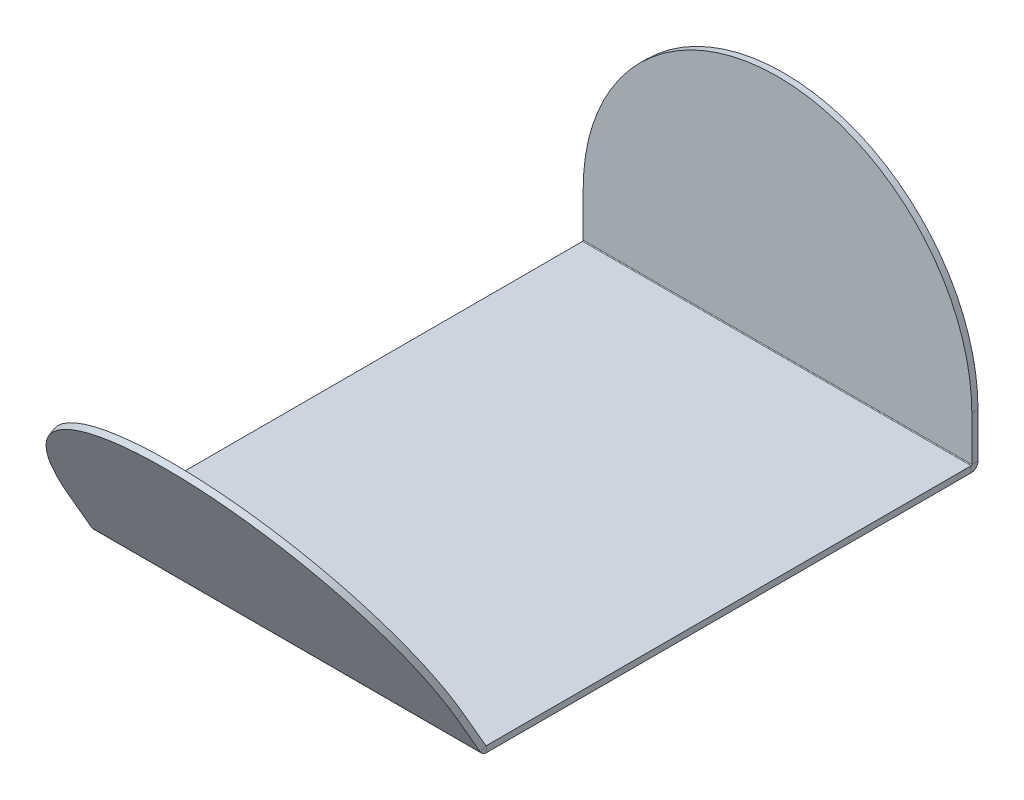
ISO-10303-21;
HEADER;
FILE_DESCRIPTION(('STEP AP214'),'2;1');
FILE_NAME('part.step','',(''),(''),'','','');
FILE_SCHEMA(('AUTOMOTIVE_DESIGN { 1 0 10303 214 1 1 1 1 }'));
ENDSEC;
DATA;
#1=APPLICATION_CONTEXT('core data for automotive mechanical design processes');
#2=APPLICATION_PROTOCOL_DEFINITION('international standard','automotive_design',2000,#1);
#3=PRODUCT_CONTEXT('',#1,'mechanical');
#4=PRODUCT('Part','Part','',(#3));
#5=PRODUCT_RELATED_PRODUCT_CATEGORY('part','',(#4));
#6=PRODUCT_DEFINITION_FORMATION('','',#4);
#7=PRODUCT_DEFINITION_CONTEXT('part definition',#1,'design');
#8=PRODUCT_DEFINITION('design','',#6,#7);
#9=PRODUCT_DEFINITION_SHAPE('','',#8);
#10=(LENGTH_UNIT() NAMED_UNIT(*) SI_UNIT(.MILLI.,.METRE.));
#11=(NAMED_UNIT(*) PLANE_ANGLE_UNIT() SI_UNIT($,.RADIAN.));
#12=(NAMED_UNIT(*) SI_UNIT($,.STERADIAN.) SOLID_ANGLE_UNIT());
#13=UNCERTAINTY_MEASURE_WITH_UNIT(LENGTH_MEASURE(1.E-05),#10,'distance_accuracy_value','');
#14=(GEOMETRIC_REPRESENTATION_CONTEXT(3) GLOBAL_UNCERTAINTY_ASSIGNED_CONTEXT((#13)) GLOBAL_UNIT_ASSIGNED_CONTEXT((#10,
#11,#12)) REPRESENTATION_CONTEXT('',''));
#15=CARTESIAN_POINT('',(0.,0.,0.));
#16=DIRECTION('',(0.,0.,1.));
#17=DIRECTION('',(1.,0.,0.));
#18=AXIS2_PLACEMENT_3D('',#15,#16,#17);
#19=CARTESIAN_POINT('',(0.,-6.35,-300.));
#20=DIRECTION('',(0.,1.,0.));
#21=DIRECTION('',(0.,0.,1.));
#22=AXIS2_PLACEMENT_3D('',#19,#20,#21);
#23=PLANE('',#22);
#24=DIRECTION('',(0.,0.,-1.));
#25=VECTOR('',#24,1.);
#26=CARTESIAN_POINT('',(200.,-6.35,-300.));
#27=LINE('',#26,#25);
#28=CARTESIAN_POINT('',(200.,-6.35,249.574723791715));
#29=VERTEX_POINT('',#28);
#30=CARTESIAN_POINT('',(200.,-6.35000000000001,-249.2634));
#31=VERTEX_POINT('',#30);
#32=EDGE_CURVE('E96',#29,#31,#27,.T.);
#33=ORIENTED_EDGE('',*,*,#32,.F.);
#34=DIRECTION('',(-1.,0.,0.));
#35=VECTOR('',#34,1.);
#36=CARTESIAN_POINT('',(-2.43984092692818E-13,-6.35,249.574723791715));
#37=LINE('',#36,#35);
#38=CARTESIAN_POINT('',(-200.,-6.35,249.574723791715));
#39=VERTEX_POINT('',#38);
#40=EDGE_CURVE('E272',#29,#39,#37,.T.);
#41=ORIENTED_EDGE('',*,*,#40,.T.);
#42=DIRECTION('',(0.,0.,1.));
#43=VECTOR('',#42,1.);
#44=CARTESIAN_POINT('',(-200.,-6.35,-300.));
#45=LINE('',#44,#43);
#46=CARTESIAN_POINT('',(-200.,-6.35,-249.263400000001));
#47=VERTEX_POINT('',#46);
#48=EDGE_CURVE('E241',#47,#39,#45,.T.);
#49=ORIENTED_EDGE('',*,*,#48,.F.);
#50=DIRECTION('',(-1.,0.,0.));
#51=VECTOR('',#50,1.);
#52=CARTESIAN_POINT('',(0.,-6.35,-249.2634));
#53=LINE('',#52,#51);
#54=EDGE_CURVE('E233',#31,#47,#53,.T.);
#55=ORIENTED_EDGE('',*,*,#54,.F.);
#56=EDGE_LOOP('',(#33,#41,#49,#55));
#57=FACE_BOUND('',#56,.T.);
#58=ADVANCED_FACE('F92',(#57),#23,.F.);
#59=CARTESIAN_POINT('',(0.,46.7253110226296,-256.35));
#60=DIRECTION('',(0.,0.,1.));
#61=DIRECTION('',(0.,-1.,0.));
#62=AXIS2_PLACEMENT_3D('',#59,#60,#61);
#63=PLANE('',#62);
#64=DIRECTION('',(0.,1.,0.));
#65=VECTOR('',#64,1.);
#66=CARTESIAN_POINT('',(200.,46.7253110226296,-256.35));
#67=LINE('',#66,#65);
#68=CARTESIAN_POINT('',(200.,0.736600000000372,-256.35));
#69=VERTEX_POINT('',#68);
#70=CARTESIAN_POINT('',(200.,46.7253110226296,-256.35));
#71=VERTEX_POINT('',#70);
#72=EDGE_CURVE('E262',#69,#71,#67,.T.);
#73=ORIENTED_EDGE('',*,*,#72,.F.);
#74=DIRECTION('',(-1.,0.,0.));
#75=VECTOR('',#74,1.);
#76=CARTESIAN_POINT('',(0.,0.736600000000032,-256.35));
#77=LINE('',#76,#75);
#78=CARTESIAN_POINT('',(-200.,0.736600000000032,-256.35));
#79=VERTEX_POINT('',#78);
#80=EDGE_CURVE('E259',#69,#79,#77,.T.);
#81=ORIENTED_EDGE('',*,*,#80,.T.);
#82=DIRECTION('',(0.,-1.,0.));
#83=VECTOR('',#82,1.);
#84=CARTESIAN_POINT('',(-200.,46.7253110226297,-256.35));
#85=LINE('',#84,#83);
#86=CARTESIAN_POINT('',(-200.,46.7253110226297,-256.35));
#87=VERTEX_POINT('',#86);
#88=EDGE_CURVE('E250',#87,#79,#85,.T.);
#89=ORIENTED_EDGE('',*,*,#88,.F.);
#90=CARTESIAN_POINT('',(0.,46.7253110226296,-256.35));
#91=DIRECTION('',(0.,0.,1.));
#92=DIRECTION('',(0.,-1.,0.));
#93=AXIS2_PLACEMENT_3D('',#90,#91,#92);
#94=CIRCLE('',#93,200.);
#95=EDGE_CURVE('E247',#71,#87,#94,.T.);
#96=ORIENTED_EDGE('',*,*,#95,.F.);
#97=EDGE_LOOP('',(#73,#81,#89,#96));
#98=FACE_BOUND('',#97,.T.);
#99=ADVANCED_FACE('F316',(#98),#63,.F.);
#100=CARTESIAN_POINT('',(0.,46.7253110226296,-256.35));
#101=DIRECTION('',(0.,0.,1.));
#102=DIRECTION('',(0.,-1.,0.));
#103=AXIS2_PLACEMENT_3D('',#100,#101,#102);
#104=CYLINDRICAL_SURFACE('',#103,200.);
#105=CARTESIAN_POINT('',(0.,46.7253110226296,-250.));
#106=DIRECTION('',(0.,0.,1.));
#107=DIRECTION('',(0.,-1.,0.));
#108=AXIS2_PLACEMENT_3D('',#105,#106,#107);
#109=CIRCLE('',#108,200.);
#110=CARTESIAN_POINT('',(200.,46.7253110226296,-250.));
#111=VERTEX_POINT('',#110);
#112=CARTESIAN_POINT('',(-200.,46.7253110226297,-250.));
#113=VERTEX_POINT('',#112);
#114=EDGE_CURVE('E252',#111,#113,#109,.T.);
#115=ORIENTED_EDGE('',*,*,#114,.F.);
#116=DIRECTION('',(0.,0.,1.));
#117=VECTOR('',#116,1.);
#118=CARTESIAN_POINT('',(200.,46.7253110226296,-256.35));
#119=LINE('',#118,#117);
#120=EDGE_CURVE('E256',#71,#111,#119,.T.);
#121=ORIENTED_EDGE('',*,*,#120,.F.);
#122=ORIENTED_EDGE('',*,*,#95,.T.);
#123=DIRECTION('',(0.,0.,1.));
#124=VECTOR('',#123,1.);
#125=CARTESIAN_POINT('',(-200.,46.7253110226297,-256.35));
#126=LINE('',#125,#124);
#127=EDGE_CURVE('E260',#87,#113,#126,.T.);
#128=ORIENTED_EDGE('',*,*,#127,.T.);
#129=EDGE_LOOP('',(#115,#121,#122,#128));
#130=FACE_BOUND('',#129,.T.);
#131=ADVANCED_FACE('F321',(#130),#104,.T.);
#132=CARTESIAN_POINT('',(200.,46.7253110226296,-256.35));
#133=DIRECTION('',(1.,0.,0.));
#134=DIRECTION('',(0.,1.,0.));
#135=AXIS2_PLACEMENT_3D('',#132,#133,#134);
#136=PLANE('',#135);
#137=DIRECTION('',(0.,0.,1.));
#138=VECTOR('',#137,1.);
#139=CARTESIAN_POINT('',(200.,0.736600000000032,-256.35));
#140=LINE('',#139,#138);
#141=CARTESIAN_POINT('',(200.,0.736600000000039,-250.));
#142=VERTEX_POINT('',#141);
#143=EDGE_CURVE('E265',#69,#142,#140,.T.);
#144=ORIENTED_EDGE('',*,*,#143,.F.);
#145=ORIENTED_EDGE('',*,*,#72,.T.);
#146=ORIENTED_EDGE('',*,*,#120,.T.);
#147=DIRECTION('',(0.,1.,0.));
#148=VECTOR('',#147,1.);
#149=CARTESIAN_POINT('',(200.,46.7253110226296,-250.));
#150=LINE('',#149,#148);
#151=EDGE_CURVE('E251',#142,#111,#150,.T.);
#152=ORIENTED_EDGE('',*,*,#151,.F.);
#153=EDGE_LOOP('',(#144,#145,#146,#152));
#154=FACE_BOUND('',#153,.T.);
#155=ADVANCED_FACE('F324',(#154),#136,.T.);
#156=CARTESIAN_POINT('',(-200.,46.7253110226297,-256.35));
#157=DIRECTION('',(-1.,0.,0.));
#158=DIRECTION('',(0.,-1.,0.));
#159=AXIS2_PLACEMENT_3D('',#156,#157,#158);
#160=PLANE('',#159);
#161=DIRECTION('',(0.,0.,-1.));
#162=VECTOR('',#161,1.);
#163=CARTESIAN_POINT('',(-200.,0.736600000000032,-256.35));
#164=LINE('',#163,#162);
#165=CARTESIAN_POINT('',(-200.,0.736600000000039,-250.));
#166=VERTEX_POINT('',#165);
#167=EDGE_CURVE('E269',#166,#79,#164,.T.);
#168=ORIENTED_EDGE('',*,*,#167,.F.);
#169=DIRECTION('',(0.,-1.,0.));
#170=VECTOR('',#169,1.);
#171=CARTESIAN_POINT('',(-200.,46.7253110226297,-250.));
#172=LINE('',#171,#170);
#173=EDGE_CURVE('E255',#113,#166,#172,.T.);
#174=ORIENTED_EDGE('',*,*,#173,.F.);
#175=ORIENTED_EDGE('',*,*,#127,.F.);
#176=ORIENTED_EDGE('',*,*,#88,.T.);
#177=EDGE_LOOP('',(#168,#174,#175,#176));
#178=FACE_BOUND('',#177,.T.);
#179=ADVANCED_FACE('F318',(#178),#160,.T.);
#180=CARTESIAN_POINT('',(0.,46.7253110226296,-250.));
#181=DIRECTION('',(0.,0.,1.));
#182=DIRECTION('',(0.,-1.,0.));
#183=AXIS2_PLACEMENT_3D('',#180,#181,#182);
#184=PLANE('',#183);
#185=DIRECTION('',(-1.,0.,0.));
#186=VECTOR('',#185,1.);
#187=CARTESIAN_POINT('',(0.,0.736600000000032,-250.));
#188=LINE('',#187,#186);
#189=EDGE_CURVE('E267',#142,#166,#188,.T.);
#190=ORIENTED_EDGE('',*,*,#189,.F.);
#191=ORIENTED_EDGE('',*,*,#151,.T.);
#192=ORIENTED_EDGE('',*,*,#114,.T.);
#193=ORIENTED_EDGE('',*,*,#173,.T.);
#194=EDGE_LOOP('',(#190,#191,#192,#193));
#195=FACE_BOUND('',#194,.T.);
#196=ADVANCED_FACE('F327',(#195),#184,.T.);
#197=CARTESIAN_POINT('',(200.,-6.35,-300.));
#198=DIRECTION('',(1.,0.,0.));
#199=DIRECTION('',(0.,0.,-1.));
#200=AXIS2_PLACEMENT_3D('',#197,#198,#199);
#201=PLANE('',#200);
#202=DIRECTION('',(0.,1.,0.));
#203=VECTOR('',#202,1.);
#204=CARTESIAN_POINT('',(200.,-6.34999999999997,249.574723791715));
#205=LINE('',#204,#203);
#206=CARTESIAN_POINT('',(200.,0.,249.574723791715));
#207=VERTEX_POINT('',#206);
#208=EDGE_CURVE('E281',#29,#207,#205,.T.);
#209=ORIENTED_EDGE('',*,*,#208,.F.);
#210=ORIENTED_EDGE('',*,*,#32,.T.);
#211=DIRECTION('',(0.,1.,0.));
#212=VECTOR('',#211,1.);
#213=CARTESIAN_POINT('',(200.,-6.35,-249.2634));
#214=LINE('',#213,#212);
#215=CARTESIAN_POINT('',(200.,0.,-249.2634));
#216=VERTEX_POINT('',#215);
#217=EDGE_CURVE('E244',#31,#216,#214,.T.);
#218=ORIENTED_EDGE('',*,*,#217,.T.);
#219=DIRECTION('',(0.,0.,-1.));
#220=VECTOR('',#219,1.);
#221=CARTESIAN_POINT('',(200.,0.,-300.));
#222=LINE('',#221,#220);
#223=EDGE_CURVE('E117',#207,#216,#222,.T.);
#224=ORIENTED_EDGE('',*,*,#223,.F.);
#225=EDGE_LOOP('',(#209,#210,#218,#224));
#226=FACE_BOUND('',#225,.T.);
#227=ADVANCED_FACE('F299',(#226),#201,.T.);
#228=CARTESIAN_POINT('',(0.,0.,-300.));
#229=DIRECTION('',(0.,1.,0.));
#230=DIRECTION('',(0.,0.,1.));
#231=AXIS2_PLACEMENT_3D('',#228,#229,#230);
#232=PLANE('',#231);
#233=DIRECTION('',(-1.,0.,0.));
#234=VECTOR('',#233,1.);
#235=CARTESIAN_POINT('',(-2.43984092692818E-13,0.,249.574723791715));
#236=LINE('',#235,#234);
#237=CARTESIAN_POINT('',(-200.,0.,249.574723791715));
#238=VERTEX_POINT('',#237);
#239=EDGE_CURVE('E101',#207,#238,#236,.T.);
#240=ORIENTED_EDGE('',*,*,#239,.F.);
#241=ORIENTED_EDGE('',*,*,#223,.T.);
#242=DIRECTION('',(-1.,0.,0.));
#243=VECTOR('',#242,1.);
#244=CARTESIAN_POINT('',(0.,0.,-249.2634));
#245=LINE('',#244,#243);
#246=CARTESIAN_POINT('',(-200.,0.,-249.2634));
#247=VERTEX_POINT('',#246);
#248=EDGE_CURVE('E242',#216,#247,#245,.T.);
#249=ORIENTED_EDGE('',*,*,#248,.T.);
#250=DIRECTION('',(0.,0.,1.));
#251=VECTOR('',#250,1.);
#252=CARTESIAN_POINT('',(-200.,0.,-300.));
#253=LINE('',#252,#251);
#254=EDGE_CURVE('E109',#247,#238,#253,.T.);
#255=ORIENTED_EDGE('',*,*,#254,.T.);
#256=EDGE_LOOP('',(#240,#241,#249,#255));
#257=FACE_BOUND('',#256,.T.);
#258=ADVANCED_FACE('F287',(#257),#232,.T.);
#259=CARTESIAN_POINT('',(-200.,-6.35,-300.));
#260=DIRECTION('',(-1.,0.,0.));
#261=DIRECTION('',(0.,0.,1.));
#262=AXIS2_PLACEMENT_3D('',#259,#260,#261);
#263=PLANE('',#262);
#264=DIRECTION('',(0.,-1.,0.));
#265=VECTOR('',#264,1.);
#266=CARTESIAN_POINT('',(-200.,-6.34999999999997,249.574723791715));
#267=LINE('',#266,#265);
#268=EDGE_CURVE('E12',#238,#39,#267,.T.);
#269=ORIENTED_EDGE('',*,*,#268,.F.);
#270=ORIENTED_EDGE('',*,*,#254,.F.);
#271=DIRECTION('',(0.,-1.,0.));
#272=VECTOR('',#271,1.);
#273=CARTESIAN_POINT('',(-200.,-6.35,-249.2634));
#274=LINE('',#273,#272);
#275=EDGE_CURVE('E238',#247,#47,#274,.T.);
#276=ORIENTED_EDGE('',*,*,#275,.T.);
#277=ORIENTED_EDGE('',*,*,#48,.T.);
#278=EDGE_LOOP('',(#269,#270,#276,#277));
#279=FACE_BOUND('',#278,.T.);
#280=ADVANCED_FACE('F94',(#279),#263,.T.);
#281=CARTESIAN_POINT('',(200.,0.7366,-249.2634));
#282=DIRECTION('',(1.,0.,0.));
#283=DIRECTION('',(0.,0.,-1.));
#284=AXIS2_PLACEMENT_3D('',#281,#282,#283);
#285=PLANE('',#284);
#286=ORIENTED_EDGE('',*,*,#143,.T.);
#287=CARTESIAN_POINT('',(200.,0.7366,-249.2634));
#288=DIRECTION('',(1.,0.,0.));
#289=DIRECTION('',(0.,0.,-1.));
#290=AXIS2_PLACEMENT_3D('',#287,#288,#289);
#291=CIRCLE('',#290,0.7366);
#292=EDGE_CURVE('E222',#142,#216,#291,.F.);
#293=ORIENTED_EDGE('',*,*,#292,.T.);
#294=ORIENTED_EDGE('',*,*,#217,.F.);
#295=CARTESIAN_POINT('',(200.,0.7366,-249.2634));
#296=DIRECTION('',(-1.,0.,0.));
#297=DIRECTION('',(0.,0.,-1.));
#298=AXIS2_PLACEMENT_3D('',#295,#296,#297);
#299=CIRCLE('',#298,7.08660000000001);
#300=EDGE_CURVE('E227',#69,#31,#299,.T.);
#301=ORIENTED_EDGE('',*,*,#300,.F.);
#302=EDGE_LOOP('',(#286,#293,#294,#301));
#303=FACE_BOUND('',#302,.T.);
#304=ADVANCED_FACE('F292',(#303),#285,.T.);
#305=CARTESIAN_POINT('',(-200.,0.7366,-249.2634));
#306=DIRECTION('',(-1.,0.,0.));
#307=DIRECTION('',(0.,0.,1.));
#308=AXIS2_PLACEMENT_3D('',#305,#306,#307);
#309=PLANE('',#308);
#310=CARTESIAN_POINT('',(-200.,0.7366,-249.2634));
#311=DIRECTION('',(1.,0.,0.));
#312=DIRECTION('',(0.,0.,-1.));
#313=AXIS2_PLACEMENT_3D('',#310,#311,#312);
#314=CIRCLE('',#313,0.7366);
#315=EDGE_CURVE('E231',#247,#166,#314,.T.);
#316=ORIENTED_EDGE('',*,*,#315,.T.);
#317=ORIENTED_EDGE('',*,*,#167,.T.);
#318=CARTESIAN_POINT('',(-200.,0.7366,-249.2634));
#319=DIRECTION('',(1.,0.,0.));
#320=DIRECTION('',(0.,0.,1.));
#321=AXIS2_PLACEMENT_3D('',#318,#319,#320);
#322=CIRCLE('',#321,7.08660000000001);
#323=EDGE_CURVE('E230',#47,#79,#322,.T.);
#324=ORIENTED_EDGE('',*,*,#323,.F.);
#325=ORIENTED_EDGE('',*,*,#275,.F.);
#326=EDGE_LOOP('',(#316,#317,#324,#325));
#327=FACE_BOUND('',#326,.T.);
#328=ADVANCED_FACE('F309',(#327),#309,.T.);
#329=CARTESIAN_POINT('',(-400.078573469939,0.7366,-249.2634));
#330=DIRECTION('',(1.,0.,0.));
#331=DIRECTION('',(0.,0.,-1.));
#332=AXIS2_PLACEMENT_3D('',#329,#330,#331);
#333=CYLINDRICAL_SURFACE('',#332,7.0866);
#334=ORIENTED_EDGE('',*,*,#54,.T.);
#335=ORIENTED_EDGE('',*,*,#323,.T.);
#336=ORIENTED_EDGE('',*,*,#80,.F.);
#337=ORIENTED_EDGE('',*,*,#300,.T.);
#338=EDGE_LOOP('',(#334,#335,#336,#337));
#339=FACE_BOUND('',#338,.T.);
#340=ADVANCED_FACE('F307',(#339),#333,.T.);
#341=CARTESIAN_POINT('',(-400.078573469939,0.7366,-249.2634));
#342=DIRECTION('',(1.,0.,0.));
#343=DIRECTION('',(0.,0.,-1.));
#344=AXIS2_PLACEMENT_3D('',#341,#342,#343);
#345=CYLINDRICAL_SURFACE('',#344,0.7366);
#346=ORIENTED_EDGE('',*,*,#248,.F.);
#347=ORIENTED_EDGE('',*,*,#292,.F.);
#348=ORIENTED_EDGE('',*,*,#189,.T.);
#349=ORIENTED_EDGE('',*,*,#315,.F.);
#350=EDGE_LOOP('',(#346,#347,#348,#349));
#351=FACE_BOUND('',#350,.T.);
#352=ADVANCED_FACE('F298',(#351),#345,.F.);
#353=CARTESIAN_POINT('',(200.,0.7366,249.574723791715));
#354=DIRECTION('',(1.,0.,0.));
#355=DIRECTION('',(0.,0.,-1.));
#356=AXIS2_PLACEMENT_3D('',#353,#354,#355);
#357=PLANE('',#356);
#358=ORIENTED_EDGE('',*,*,#208,.T.);
#359=CARTESIAN_POINT('',(200.,0.7366,249.574723791715));
#360=DIRECTION('',(-1.,0.,0.));
#361=DIRECTION('',(0.,0.,1.));
#362=AXIS2_PLACEMENT_3D('',#359,#360,#361);
#363=CIRCLE('',#362,0.7366);
#364=CARTESIAN_POINT('',(200.,0.368299999999822,250.212638104143));
#365=VERTEX_POINT('',#364);
#366=EDGE_CURVE('E203',#207,#365,#363,.T.);
#367=ORIENTED_EDGE('',*,*,#366,.T.);
#368=DIRECTION('',(0.,0.499999999999998,-0.86602540378444));
#369=VECTOR('',#368,1.);
#370=CARTESIAN_POINT('',(200.,-2.80670000000013,255.711899418174));
#371=LINE('',#370,#369);
#372=CARTESIAN_POINT('',(200.,-2.80670000000016,255.711899418174));
#373=VERTEX_POINT('',#372);
#374=EDGE_CURVE('E366',#373,#365,#371,.T.);
#375=ORIENTED_EDGE('',*,*,#374,.F.);
#376=CARTESIAN_POINT('',(200.,0.7366,249.574723791715));
#377=DIRECTION('',(-1.,0.,0.));
#378=DIRECTION('',(0.,0.,-1.));
#379=AXIS2_PLACEMENT_3D('',#376,#377,#378);
#380=CIRCLE('',#379,7.08660000000001);
#381=EDGE_CURVE('E215',#29,#373,#380,.T.);
#382=ORIENTED_EDGE('',*,*,#381,.F.);
#383=EDGE_LOOP('',(#358,#367,#375,#382));
#384=FACE_BOUND('',#383,.T.);
#385=ADVANCED_FACE('F364',(#384),#357,.T.);
#386=CARTESIAN_POINT('',(-200.,0.7366,249.574723791715));
#387=DIRECTION('',(-1.,0.,0.));
#388=DIRECTION('',(0.,0.,1.));
#389=AXIS2_PLACEMENT_3D('',#386,#387,#388);
#390=PLANE('',#389);
#391=DIRECTION('',(0.,-0.499999999999998,0.86602540378444));
#392=VECTOR('',#391,1.);
#393=CARTESIAN_POINT('',(-200.,-2.80670000000019,255.711899418174));
#394=LINE('',#393,#392);
#395=CARTESIAN_POINT('',(-200.,0.368299999999794,250.212638104143));
#396=VERTEX_POINT('',#395);
#397=CARTESIAN_POINT('',(-200.,-2.80669999999975,255.711899418174));
#398=VERTEX_POINT('',#397);
#399=EDGE_CURVE('E191',#396,#398,#394,.T.);
#400=ORIENTED_EDGE('',*,*,#399,.F.);
#401=CARTESIAN_POINT('',(-200.,0.7366,249.574723791715));
#402=DIRECTION('',(-1.,0.,0.));
#403=DIRECTION('',(0.,0.,1.));
#404=AXIS2_PLACEMENT_3D('',#401,#402,#403);
#405=CIRCLE('',#404,0.7366);
#406=EDGE_CURVE('E219',#396,#238,#405,.F.);
#407=ORIENTED_EDGE('',*,*,#406,.T.);
#408=ORIENTED_EDGE('',*,*,#268,.T.);
#409=CARTESIAN_POINT('',(-200.,0.7366,249.574723791715));
#410=DIRECTION('',(1.,0.,0.));
#411=DIRECTION('',(0.,0.,1.));
#412=AXIS2_PLACEMENT_3D('',#409,#410,#411);
#413=CIRCLE('',#412,7.0866);
#414=EDGE_CURVE('E218',#398,#39,#413,.T.);
#415=ORIENTED_EDGE('',*,*,#414,.F.);
#416=EDGE_LOOP('',(#400,#407,#408,#415));
#417=FACE_BOUND('',#416,.T.);
#418=ADVANCED_FACE('F355',(#417),#390,.T.);
#419=CARTESIAN_POINT('',(400.062921759255,0.7366,249.574723791715));
#420=DIRECTION('',(-1.,0.,0.));
#421=DIRECTION('',(0.,0.,1.));
#422=AXIS2_PLACEMENT_3D('',#419,#420,#421);
#423=CYLINDRICAL_SURFACE('',#422,7.0866);
#424=ORIENTED_EDGE('',*,*,#414,.T.);
#425=ORIENTED_EDGE('',*,*,#40,.F.);
#426=ORIENTED_EDGE('',*,*,#381,.T.);
#427=DIRECTION('',(-1.,0.,0.));
#428=VECTOR('',#427,1.);
#429=CARTESIAN_POINT('',(-2.39069837322764E-13,-2.80670000000011,255.711899418174));
#430=LINE('',#429,#428);
#431=EDGE_CURVE('E209',#373,#398,#430,.T.);
#432=ORIENTED_EDGE('',*,*,#431,.T.);
#433=EDGE_LOOP('',(#424,#425,#426,#432));
#434=FACE_BOUND('',#433,.T.);
#435=ADVANCED_FACE('F368',(#434),#423,.T.);
#436=CARTESIAN_POINT('',(400.062921759255,0.7366,249.574723791715));
#437=DIRECTION('',(-1.,0.,0.));
#438=DIRECTION('',(0.,0.,1.));
#439=AXIS2_PLACEMENT_3D('',#436,#437,#438);
#440=CYLINDRICAL_SURFACE('',#439,0.7366);
#441=ORIENTED_EDGE('',*,*,#406,.F.);
#442=DIRECTION('',(-1.,0.,0.));
#443=VECTOR('',#442,1.);
#444=CARTESIAN_POINT('',(-2.37543485690447E-13,0.368299999999794,250.212638104143));
#445=LINE('',#444,#443);
#446=EDGE_CURVE('E361',#365,#396,#445,.T.);
#447=ORIENTED_EDGE('',*,*,#446,.F.);
#448=ORIENTED_EDGE('',*,*,#366,.F.);
#449=ORIENTED_EDGE('',*,*,#239,.T.);
#450=EDGE_LOOP('',(#441,#447,#448,#449));
#451=FACE_BOUND('',#450,.T.);
#452=ADVANCED_FACE('F359',(#451),#440,.F.);
#453=CARTESIAN_POINT('',(1.04601991381176E-13,38.1216752100545,279.341907863193));
#454=DIRECTION('',(0.,0.499999999999998,-0.86602540378444));
#455=DIRECTION('',(0.,0.86602540378444,0.499999999999998));
#456=AXIS2_PLACEMENT_3D('',#453,#454,#455);
#457=CYLINDRICAL_SURFACE('',#456,200.);
#458=CARTESIAN_POINT('',(1.06128343013493E-13,41.2966752100545,273.842646549162));
#459=DIRECTION('',(0.,0.499999999999998,-0.86602540378444));
#460=DIRECTION('',(0.,0.86602540378444,0.499999999999998));
#461=AXIS2_PLACEMENT_3D('',#458,#459,#460);
#462=CIRCLE('',#461,200.);
#463=CARTESIAN_POINT('',(-200.,41.2966752100545,273.842646549162));
#464=VERTEX_POINT('',#463);
#465=CARTESIAN_POINT('',(200.,41.2966752100545,273.842646549162));
#466=VERTEX_POINT('',#465);
#467=EDGE_CURVE('E202',#464,#466,#462,.T.);
#468=ORIENTED_EDGE('',*,*,#467,.F.);
#469=DIRECTION('',(0.,0.499999999999998,-0.86602540378444));
#470=VECTOR('',#469,1.);
#471=CARTESIAN_POINT('',(-200.,38.1216752100545,279.341907863193));
#472=LINE('',#471,#470);
#473=CARTESIAN_POINT('',(-200.,38.1216752100545,279.341907863193));
#474=VERTEX_POINT('',#473);
#475=EDGE_CURVE('E188',#474,#464,#472,.T.);
#476=ORIENTED_EDGE('',*,*,#475,.F.);
#477=CARTESIAN_POINT('',(1.04601991381176E-13,38.1216752100545,279.341907863193));
#478=DIRECTION('',(0.,0.499999999999998,-0.86602540378444));
#479=DIRECTION('',(0.,0.86602540378444,0.499999999999998));
#480=AXIS2_PLACEMENT_3D('',#477,#478,#479);
#481=CIRCLE('',#480,200.);
#482=CARTESIAN_POINT('',(200.,38.1216752100545,279.341907863193));
#483=VERTEX_POINT('',#482);
#484=EDGE_CURVE('E199',#474,#483,#481,.T.);
#485=ORIENTED_EDGE('',*,*,#484,.T.);
#486=DIRECTION('',(0.,0.499999999999998,-0.86602540378444));
#487=VECTOR('',#486,1.);
#488=CARTESIAN_POINT('',(200.,38.1216752100545,279.341907863193));
#489=LINE('',#488,#487);
#490=EDGE_CURVE('E208',#483,#466,#489,.T.);
#491=ORIENTED_EDGE('',*,*,#490,.T.);
#492=EDGE_LOOP('',(#468,#476,#485,#491));
#493=FACE_BOUND('',#492,.T.);
#494=ADVANCED_FACE('F198',(#493),#457,.T.);
#495=CARTESIAN_POINT('',(-1.62361755337814E-13,-481.493567060609,-20.6580921368059));
#496=DIRECTION('',(0.,0.499999999999998,-0.86602540378444));
#497=DIRECTION('',(0.,0.86602540378444,0.499999999999998));
#498=AXIS2_PLACEMENT_3D('',#495,#496,#497);
#499=PLANE('',#498);
#500=ORIENTED_EDGE('',*,*,#431,.F.);
#501=DIRECTION('',(0.,-0.86602540378444,-0.499999999999998));
#502=VECTOR('',#501,1.);
#503=CARTESIAN_POINT('',(200.,-481.49356706061,-20.6580921368059));
#504=LINE('',#503,#502);
#505=EDGE_CURVE('E207',#483,#373,#504,.T.);
#506=ORIENTED_EDGE('',*,*,#505,.F.);
#507=ORIENTED_EDGE('',*,*,#484,.F.);
#508=DIRECTION('',(0.,0.86602540378444,0.499999999999998));
#509=VECTOR('',#508,1.);
#510=CARTESIAN_POINT('',(-200.,-481.493567060609,-20.6580921368059));
#511=LINE('',#510,#509);
#512=EDGE_CURVE('E185',#398,#474,#511,.T.);
#513=ORIENTED_EDGE('',*,*,#512,.F.);
#514=EDGE_LOOP('',(#500,#506,#507,#513));
#515=FACE_BOUND('',#514,.T.);
#516=ADVANCED_FACE('F205',(#515),#499,.F.);
#517=CARTESIAN_POINT('',(200.,-481.49356706061,-20.6580921368059));
#518=DIRECTION('',(1.,0.,0.));
#519=DIRECTION('',(0.,-0.86602540378444,-0.499999999999998));
#520=AXIS2_PLACEMENT_3D('',#517,#518,#519);
#521=PLANE('',#520);
#522=ORIENTED_EDGE('',*,*,#505,.T.);
#523=ORIENTED_EDGE('',*,*,#374,.T.);
#524=DIRECTION('',(0.,-0.86602540378444,-0.499999999999998));
#525=VECTOR('',#524,1.);
#526=CARTESIAN_POINT('',(200.,-478.318567060609,-26.1573534508371));
#527=LINE('',#526,#525);
#528=EDGE_CURVE('E372',#466,#365,#527,.T.);
#529=ORIENTED_EDGE('',*,*,#528,.F.);
#530=ORIENTED_EDGE('',*,*,#490,.F.);
#531=EDGE_LOOP('',(#522,#523,#529,#530));
#532=FACE_BOUND('',#531,.T.);
#533=ADVANCED_FACE('F370',(#532),#521,.T.);
#534=CARTESIAN_POINT('',(-1.60835403705497E-13,-478.318567060609,-26.1573534508371));
#535=DIRECTION('',(0.,0.499999999999998,-0.86602540378444));
#536=DIRECTION('',(0.,0.86602540378444,0.499999999999998));
#537=AXIS2_PLACEMENT_3D('',#534,#535,#536);
#538=PLANE('',#537);
#539=ORIENTED_EDGE('',*,*,#528,.T.);
#540=ORIENTED_EDGE('',*,*,#446,.T.);
#541=DIRECTION('',(0.,0.86602540378444,0.499999999999998));
#542=VECTOR('',#541,1.);
#543=CARTESIAN_POINT('',(-200.,-478.318567060609,-26.1573534508371));
#544=LINE('',#543,#542);
#545=EDGE_CURVE('E377',#396,#464,#544,.T.);
#546=ORIENTED_EDGE('',*,*,#545,.T.);
#547=ORIENTED_EDGE('',*,*,#467,.T.);
#548=EDGE_LOOP('',(#539,#540,#546,#547));
#549=FACE_BOUND('',#548,.T.);
#550=ADVANCED_FACE('F381',(#549),#538,.T.);
#551=CARTESIAN_POINT('',(-200.,-481.493567060609,-20.6580921368059));
#552=DIRECTION('',(-1.,0.,0.));
#553=DIRECTION('',(0.,0.86602540378444,0.499999999999998));
#554=AXIS2_PLACEMENT_3D('',#551,#552,#553);
#555=PLANE('',#554);
#556=ORIENTED_EDGE('',*,*,#545,.F.);
#557=ORIENTED_EDGE('',*,*,#399,.T.);
#558=ORIENTED_EDGE('',*,*,#512,.T.);
#559=ORIENTED_EDGE('',*,*,#475,.T.);
#560=EDGE_LOOP('',(#556,#557,#558,#559));
#561=FACE_BOUND('',#560,.T.);
#562=ADVANCED_FACE('F187',(#561),#555,.T.);
#563=CLOSED_SHELL('',(#58,#99,#131,#155,#179,#196,#227,#258,#280,#304,#328,#340,#352,#385,#418,
#435,#452,#494,#516,#533,#550,#562));
#564=MANIFOLD_SOLID_BREP('B2',#563);
#565=ADVANCED_BREP_SHAPE_REPRESENTATION('',(#18,#564),#14);
#566=SHAPE_DEFINITION_REPRESENTATION(#9,#565);
ENDSEC;
END-ISO-10303-21;
